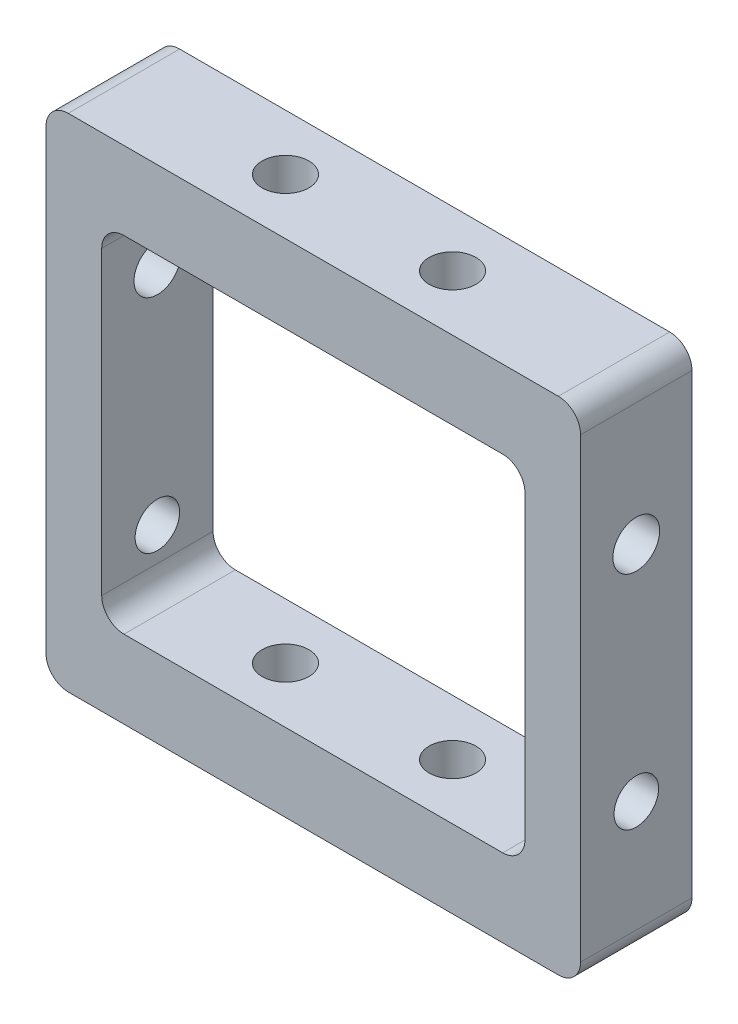
ISO-10303-21;
HEADER;
FILE_DESCRIPTION(('STEP AP214'),'2;1');
FILE_NAME('part.step','',(''),(''),'','','');
FILE_SCHEMA(('AUTOMOTIVE_DESIGN { 1 0 10303 214 1 1 1 1 }'));
ENDSEC;
DATA;
#1=APPLICATION_CONTEXT('core data for automotive mechanical design processes');
#2=APPLICATION_PROTOCOL_DEFINITION('international standard','automotive_design',2000,#1);
#3=PRODUCT_CONTEXT('',#1,'mechanical');
#4=PRODUCT('Part','Part','',(#3));
#5=PRODUCT_RELATED_PRODUCT_CATEGORY('part','',(#4));
#6=PRODUCT_DEFINITION_FORMATION('','',#4);
#7=PRODUCT_DEFINITION_CONTEXT('part definition',#1,'design');
#8=PRODUCT_DEFINITION('design','',#6,#7);
#9=PRODUCT_DEFINITION_SHAPE('','',#8);
#10=(LENGTH_UNIT() NAMED_UNIT(*) SI_UNIT(.MILLI.,.METRE.));
#11=(NAMED_UNIT(*) PLANE_ANGLE_UNIT() SI_UNIT($,.RADIAN.));
#12=(NAMED_UNIT(*) SI_UNIT($,.STERADIAN.) SOLID_ANGLE_UNIT());
#13=UNCERTAINTY_MEASURE_WITH_UNIT(LENGTH_MEASURE(1.E-05),#10,'distance_accuracy_value','');
#14=(GEOMETRIC_REPRESENTATION_CONTEXT(3) GLOBAL_UNCERTAINTY_ASSIGNED_CONTEXT((#13)) GLOBAL_UNIT_ASSIGNED_CONTEXT((#10,
#11,#12)) REPRESENTATION_CONTEXT('',''));
#15=CARTESIAN_POINT('',(0.,0.,0.));
#16=DIRECTION('',(0.,0.,1.));
#17=DIRECTION('',(1.,0.,0.));
#18=AXIS2_PLACEMENT_3D('',#15,#16,#17);
#19=CARTESIAN_POINT('',(-24.,22.5,10.));
#20=DIRECTION('',(0.,-1.,0.));
#21=DIRECTION('',(0.,0.,-1.));
#22=AXIS2_PLACEMENT_3D('',#19,#20,#21);
#23=PLANE('',#22);
#24=DIRECTION('',(-1.,0.,0.));
#25=VECTOR('',#24,1.);
#26=CARTESIAN_POINT('',(-24.,22.5,10.));
#27=LINE('',#26,#25);
#28=CARTESIAN_POINT('',(22.,22.5,10.));
#29=VERTEX_POINT('',#28);
#30=CARTESIAN_POINT('',(-22.,22.5,10.));
#31=VERTEX_POINT('',#30);
#32=EDGE_CURVE('E214',#29,#31,#27,.T.);
#33=ORIENTED_EDGE('',*,*,#32,.F.);
#34=DIRECTION('',(0.,0.,-1.));
#35=VECTOR('',#34,1.);
#36=CARTESIAN_POINT('',(22.,22.5,10.));
#37=LINE('',#36,#35);
#38=CARTESIAN_POINT('',(22.,22.5,0.));
#39=VERTEX_POINT('',#38);
#40=EDGE_CURVE('E11',#29,#39,#37,.T.);
#41=ORIENTED_EDGE('',*,*,#40,.T.);
#42=DIRECTION('',(-1.,0.,0.));
#43=VECTOR('',#42,1.);
#44=CARTESIAN_POINT('',(-24.,22.5,0.));
#45=LINE('',#44,#43);
#46=CARTESIAN_POINT('',(-22.,22.5,0.));
#47=VERTEX_POINT('',#46);
#48=EDGE_CURVE('E224',#39,#47,#45,.T.);
#49=ORIENTED_EDGE('',*,*,#48,.T.);
#50=DIRECTION('',(0.,0.,-1.));
#51=VECTOR('',#50,1.);
#52=CARTESIAN_POINT('',(-22.,22.5,10.));
#53=LINE('',#52,#51);
#54=EDGE_CURVE('E47',#47,#31,#53,.F.);
#55=ORIENTED_EDGE('',*,*,#54,.T.);
#56=EDGE_LOOP('',(#33,#41,#49,#55));
#57=FACE_BOUND('',#56,.T.);
#58=CARTESIAN_POINT('',(7.5,22.5,5.));
#59=DIRECTION('',(0.,1.,0.));
#60=DIRECTION('',(0.,0.,1.));
#61=AXIS2_PLACEMENT_3D('',#58,#59,#60);
#62=CIRCLE('',#61,2.09999999999999);
#63=CARTESIAN_POINT('',(7.5,22.5,7.09999999999998));
#64=VERTEX_POINT('',#63);
#65=EDGE_CURVE('E426',#64,#64,#62,.T.);
#66=ORIENTED_EDGE('',*,*,#65,.F.);
#67=EDGE_LOOP('',(#66));
#68=FACE_BOUND('',#67,.T.);
#69=CARTESIAN_POINT('',(-7.5,22.5,5.));
#70=DIRECTION('',(0.,1.,0.));
#71=DIRECTION('',(0.,0.,1.));
#72=AXIS2_PLACEMENT_3D('',#69,#70,#71);
#73=CIRCLE('',#72,2.09999999999999);
#74=CARTESIAN_POINT('',(-7.5,22.5,7.09999999999999));
#75=VERTEX_POINT('',#74);
#76=EDGE_CURVE('E668',#75,#75,#73,.T.);
#77=ORIENTED_EDGE('',*,*,#76,.F.);
#78=EDGE_LOOP('',(#77));
#79=FACE_BOUND('',#78,.T.);
#80=ADVANCED_FACE('F39',(#57,#68,#79),#23,.F.);
#81=CARTESIAN_POINT('',(24.,-22.5,10.));
#82=DIRECTION('',(-1.,0.,0.));
#83=DIRECTION('',(0.,0.,1.));
#84=AXIS2_PLACEMENT_3D('',#81,#82,#83);
#85=PLANE('',#84);
#86=CARTESIAN_POINT('',(24.,9.50000000000001,5.));
#87=DIRECTION('',(1.,0.,0.));
#88=DIRECTION('',(0.,0.,-1.));
#89=AXIS2_PLACEMENT_3D('',#86,#87,#88);
#90=CIRCLE('',#89,2.09999999999999);
#91=CARTESIAN_POINT('',(24.,9.50000000000001,2.90000000000001));
#92=VERTEX_POINT('',#91);
#93=EDGE_CURVE('E677',#92,#92,#90,.T.);
#94=ORIENTED_EDGE('',*,*,#93,.F.);
#95=EDGE_LOOP('',(#94));
#96=FACE_BOUND('',#95,.T.);
#97=CARTESIAN_POINT('',(24.,-10.5,5.));
#98=DIRECTION('',(1.,0.,0.));
#99=DIRECTION('',(0.,0.,-1.));
#100=AXIS2_PLACEMENT_3D('',#97,#98,#99);
#101=CIRCLE('',#100,2.);
#102=CARTESIAN_POINT('',(24.,-10.5,3.));
#103=VERTEX_POINT('',#102);
#104=EDGE_CURVE('E207',#103,#103,#101,.T.);
#105=ORIENTED_EDGE('',*,*,#104,.F.);
#106=EDGE_LOOP('',(#105));
#107=FACE_BOUND('',#106,.T.);
#108=DIRECTION('',(0.,1.,0.));
#109=VECTOR('',#108,1.);
#110=CARTESIAN_POINT('',(24.,-22.5,10.));
#111=LINE('',#110,#109);
#112=CARTESIAN_POINT('',(24.,-20.5,10.));
#113=VERTEX_POINT('',#112);
#114=CARTESIAN_POINT('',(24.,20.5,10.));
#115=VERTEX_POINT('',#114);
#116=EDGE_CURVE('E211',#113,#115,#111,.T.);
#117=ORIENTED_EDGE('',*,*,#116,.F.);
#118=DIRECTION('',(0.,0.,-1.));
#119=VECTOR('',#118,1.);
#120=CARTESIAN_POINT('',(24.,-20.5,10.));
#121=LINE('',#120,#119);
#122=CARTESIAN_POINT('',(24.,-20.5,0.));
#123=VERTEX_POINT('',#122);
#124=EDGE_CURVE('E276',#113,#123,#121,.T.);
#125=ORIENTED_EDGE('',*,*,#124,.T.);
#126=DIRECTION('',(0.,1.,0.));
#127=VECTOR('',#126,1.);
#128=CARTESIAN_POINT('',(24.,-22.5,0.));
#129=LINE('',#128,#127);
#130=CARTESIAN_POINT('',(24.,20.5,0.));
#131=VERTEX_POINT('',#130);
#132=EDGE_CURVE('E206',#123,#131,#129,.T.);
#133=ORIENTED_EDGE('',*,*,#132,.T.);
#134=DIRECTION('',(0.,0.,-1.));
#135=VECTOR('',#134,1.);
#136=CARTESIAN_POINT('',(24.,20.5,10.));
#137=LINE('',#136,#135);
#138=EDGE_CURVE('E259',#131,#115,#137,.F.);
#139=ORIENTED_EDGE('',*,*,#138,.T.);
#140=EDGE_LOOP('',(#117,#125,#133,#139));
#141=FACE_BOUND('',#140,.T.);
#142=ADVANCED_FACE('F331',(#96,#107,#141),#85,.F.);
#143=CARTESIAN_POINT('',(-24.,-22.5,10.));
#144=DIRECTION('',(1.,0.,0.));
#145=DIRECTION('',(0.,0.,-1.));
#146=AXIS2_PLACEMENT_3D('',#143,#144,#145);
#147=PLANE('',#146);
#148=CARTESIAN_POINT('',(-24.,9.50000000000001,5.));
#149=DIRECTION('',(1.,0.,0.));
#150=DIRECTION('',(0.,0.,-1.));
#151=AXIS2_PLACEMENT_3D('',#148,#149,#150);
#152=CIRCLE('',#151,2.09999999999999);
#153=CARTESIAN_POINT('',(-24.,9.50000000000001,2.90000000000001));
#154=VERTEX_POINT('',#153);
#155=EDGE_CURVE('E274',#154,#154,#152,.T.);
#156=ORIENTED_EDGE('',*,*,#155,.T.);
#157=EDGE_LOOP('',(#156));
#158=FACE_BOUND('',#157,.T.);
#159=CARTESIAN_POINT('',(-24.,-10.5,5.));
#160=DIRECTION('',(1.,0.,0.));
#161=DIRECTION('',(0.,0.,-1.));
#162=AXIS2_PLACEMENT_3D('',#159,#160,#161);
#163=CIRCLE('',#162,2.);
#164=CARTESIAN_POINT('',(-24.,-10.5,3.));
#165=VERTEX_POINT('',#164);
#166=EDGE_CURVE('E203',#165,#165,#163,.T.);
#167=ORIENTED_EDGE('',*,*,#166,.T.);
#168=EDGE_LOOP('',(#167));
#169=FACE_BOUND('',#168,.T.);
#170=DIRECTION('',(0.,-1.,0.));
#171=VECTOR('',#170,1.);
#172=CARTESIAN_POINT('',(-24.,-22.5,0.));
#173=LINE('',#172,#171);
#174=CARTESIAN_POINT('',(-24.,20.5,0.));
#175=VERTEX_POINT('',#174);
#176=CARTESIAN_POINT('',(-24.,-20.5,0.));
#177=VERTEX_POINT('',#176);
#178=EDGE_CURVE('E227',#175,#177,#173,.T.);
#179=ORIENTED_EDGE('',*,*,#178,.T.);
#180=DIRECTION('',(0.,0.,-1.));
#181=VECTOR('',#180,1.);
#182=CARTESIAN_POINT('',(-24.,-20.5,10.));
#183=LINE('',#182,#181);
#184=CARTESIAN_POINT('',(-24.,-20.5,10.));
#185=VERTEX_POINT('',#184);
#186=EDGE_CURVE('E54',#177,#185,#183,.F.);
#187=ORIENTED_EDGE('',*,*,#186,.T.);
#188=DIRECTION('',(0.,-1.,0.));
#189=VECTOR('',#188,1.);
#190=CARTESIAN_POINT('',(-24.,-22.5,10.));
#191=LINE('',#190,#189);
#192=CARTESIAN_POINT('',(-24.,20.5,10.));
#193=VERTEX_POINT('',#192);
#194=EDGE_CURVE('E217',#193,#185,#191,.T.);
#195=ORIENTED_EDGE('',*,*,#194,.F.);
#196=DIRECTION('',(0.,0.,-1.));
#197=VECTOR('',#196,1.);
#198=CARTESIAN_POINT('',(-24.,20.5,10.));
#199=LINE('',#198,#197);
#200=EDGE_CURVE('E299',#193,#175,#199,.T.);
#201=ORIENTED_EDGE('',*,*,#200,.T.);
#202=EDGE_LOOP('',(#179,#187,#195,#201));
#203=FACE_BOUND('',#202,.T.);
#204=ADVANCED_FACE('F312',(#158,#169,#203),#147,.F.);
#205=CARTESIAN_POINT('',(-24.,-22.5,10.));
#206=DIRECTION('',(0.,1.,0.));
#207=DIRECTION('',(0.,0.,1.));
#208=AXIS2_PLACEMENT_3D('',#205,#206,#207);
#209=PLANE('',#208);
#210=CARTESIAN_POINT('',(-7.5,-22.5,5.));
#211=DIRECTION('',(0.,1.,0.));
#212=DIRECTION('',(0.,0.,1.));
#213=AXIS2_PLACEMENT_3D('',#210,#211,#212);
#214=CIRCLE('',#213,2.09999999999999);
#215=CARTESIAN_POINT('',(-7.5,-22.5,7.09999999999999));
#216=VERTEX_POINT('',#215);
#217=EDGE_CURVE('E269',#216,#216,#214,.T.);
#218=ORIENTED_EDGE('',*,*,#217,.T.);
#219=EDGE_LOOP('',(#218));
#220=FACE_BOUND('',#219,.T.);
#221=CARTESIAN_POINT('',(7.5,-22.5,5.));
#222=DIRECTION('',(0.,1.,0.));
#223=DIRECTION('',(0.,0.,1.));
#224=AXIS2_PLACEMENT_3D('',#221,#222,#223);
#225=CIRCLE('',#224,2.09999999999999);
#226=CARTESIAN_POINT('',(7.5,-22.5,7.09999999999999));
#227=VERTEX_POINT('',#226);
#228=EDGE_CURVE('E264',#227,#227,#225,.T.);
#229=ORIENTED_EDGE('',*,*,#228,.T.);
#230=EDGE_LOOP('',(#229));
#231=FACE_BOUND('',#230,.T.);
#232=DIRECTION('',(1.,0.,0.));
#233=VECTOR('',#232,1.);
#234=CARTESIAN_POINT('',(-24.,-22.5,0.));
#235=LINE('',#234,#233);
#236=CARTESIAN_POINT('',(-22.,-22.5,0.));
#237=VERTEX_POINT('',#236);
#238=CARTESIAN_POINT('',(22.,-22.5,0.));
#239=VERTEX_POINT('',#238);
#240=EDGE_CURVE('E215',#237,#239,#235,.T.);
#241=ORIENTED_EDGE('',*,*,#240,.T.);
#242=DIRECTION('',(0.,0.,-1.));
#243=VECTOR('',#242,1.);
#244=CARTESIAN_POINT('',(22.,-22.5,10.));
#245=LINE('',#244,#243);
#246=CARTESIAN_POINT('',(22.,-22.5,10.));
#247=VERTEX_POINT('',#246);
#248=EDGE_CURVE('E290',#239,#247,#245,.F.);
#249=ORIENTED_EDGE('',*,*,#248,.T.);
#250=DIRECTION('',(1.,0.,0.));
#251=VECTOR('',#250,1.);
#252=CARTESIAN_POINT('',(-24.,-22.5,10.));
#253=LINE('',#252,#251);
#254=CARTESIAN_POINT('',(-22.,-22.5,10.));
#255=VERTEX_POINT('',#254);
#256=EDGE_CURVE('E219',#255,#247,#253,.T.);
#257=ORIENTED_EDGE('',*,*,#256,.F.);
#258=DIRECTION('',(0.,0.,-1.));
#259=VECTOR('',#258,1.);
#260=CARTESIAN_POINT('',(-22.,-22.5,10.));
#261=LINE('',#260,#259);
#262=EDGE_CURVE('E287',#255,#237,#261,.T.);
#263=ORIENTED_EDGE('',*,*,#262,.T.);
#264=EDGE_LOOP('',(#241,#249,#257,#263));
#265=FACE_BOUND('',#264,.T.);
#266=ADVANCED_FACE('F323',(#220,#231,#265),#209,.F.);
#267=CARTESIAN_POINT('',(0.,0.,10.));
#268=DIRECTION('',(0.,0.,-1.));
#269=DIRECTION('',(-1.,0.,0.));
#270=AXIS2_PLACEMENT_3D('',#267,#268,#269);
#271=PLANE('',#270);
#272=DIRECTION('',(0.,-1.,0.));
#273=VECTOR('',#272,1.);
#274=CARTESIAN_POINT('',(-19.,0.999999999999998,10.));
#275=LINE('',#274,#273);
#276=CARTESIAN_POINT('',(-19.,13.5,10.));
#277=VERTEX_POINT('',#276);
#278=CARTESIAN_POINT('',(-19.,-13.5,10.));
#279=VERTEX_POINT('',#278);
#280=EDGE_CURVE('E185',#277,#279,#275,.T.);
#281=ORIENTED_EDGE('',*,*,#280,.F.);
#282=CARTESIAN_POINT('',(-17.,13.5,10.));
#283=DIRECTION('',(0.,0.,-1.));
#284=DIRECTION('',(-1.,0.,0.));
#285=AXIS2_PLACEMENT_3D('',#282,#283,#284);
#286=CIRCLE('',#285,2.);
#287=CARTESIAN_POINT('',(-17.,15.5,10.));
#288=VERTEX_POINT('',#287);
#289=EDGE_CURVE('E257',#277,#288,#286,.T.);
#290=ORIENTED_EDGE('',*,*,#289,.T.);
#291=DIRECTION('',(-1.,0.,0.));
#292=VECTOR('',#291,1.);
#293=CARTESIAN_POINT('',(19.,15.5,10.));
#294=LINE('',#293,#292);
#295=CARTESIAN_POINT('',(17.,15.5,10.));
#296=VERTEX_POINT('',#295);
#297=EDGE_CURVE('E188',#296,#288,#294,.T.);
#298=ORIENTED_EDGE('',*,*,#297,.F.);
#299=CARTESIAN_POINT('',(17.,13.5,10.));
#300=DIRECTION('',(0.,0.,-1.));
#301=DIRECTION('',(-1.,0.,0.));
#302=AXIS2_PLACEMENT_3D('',#299,#300,#301);
#303=CIRCLE('',#302,2.);
#304=CARTESIAN_POINT('',(19.,13.5,10.));
#305=VERTEX_POINT('',#304);
#306=EDGE_CURVE('E251',#296,#305,#303,.T.);
#307=ORIENTED_EDGE('',*,*,#306,.T.);
#308=DIRECTION('',(0.,1.,0.));
#309=VECTOR('',#308,1.);
#310=CARTESIAN_POINT('',(19.,-1.99999999999999,10.));
#311=LINE('',#310,#309);
#312=CARTESIAN_POINT('',(19.,-13.5,10.));
#313=VERTEX_POINT('',#312);
#314=EDGE_CURVE('E196',#313,#305,#311,.T.);
#315=ORIENTED_EDGE('',*,*,#314,.F.);
#316=CARTESIAN_POINT('',(17.,-13.5,10.));
#317=DIRECTION('',(0.,0.,-1.));
#318=DIRECTION('',(-1.,0.,0.));
#319=AXIS2_PLACEMENT_3D('',#316,#317,#318);
#320=CIRCLE('',#319,2.);
#321=CARTESIAN_POINT('',(17.,-15.5,10.));
#322=VERTEX_POINT('',#321);
#323=EDGE_CURVE('E182',#313,#322,#320,.T.);
#324=ORIENTED_EDGE('',*,*,#323,.T.);
#325=DIRECTION('',(1.,0.,0.));
#326=VECTOR('',#325,1.);
#327=CARTESIAN_POINT('',(-19.,-15.5,10.));
#328=LINE('',#327,#326);
#329=CARTESIAN_POINT('',(-17.,-15.5,10.));
#330=VERTEX_POINT('',#329);
#331=EDGE_CURVE('E172',#330,#322,#328,.T.);
#332=ORIENTED_EDGE('',*,*,#331,.F.);
#333=CARTESIAN_POINT('',(-17.,-13.5,10.));
#334=DIRECTION('',(0.,0.,-1.));
#335=DIRECTION('',(-1.,0.,0.));
#336=AXIS2_PLACEMENT_3D('',#333,#334,#335);
#337=CIRCLE('',#336,2.);
#338=EDGE_CURVE('E154',#330,#279,#337,.T.);
#339=ORIENTED_EDGE('',*,*,#338,.T.);
#340=EDGE_LOOP('',(#281,#290,#298,#307,#315,#324,#332,#339));
#341=FACE_BOUND('',#340,.T.);
#342=ORIENTED_EDGE('',*,*,#256,.T.);
#343=CARTESIAN_POINT('',(22.,-20.5,10.));
#344=DIRECTION('',(0.,0.,-1.));
#345=DIRECTION('',(-1.,0.,0.));
#346=AXIS2_PLACEMENT_3D('',#343,#344,#345);
#347=CIRCLE('',#346,2.);
#348=EDGE_CURVE('E297',#247,#113,#347,.F.);
#349=ORIENTED_EDGE('',*,*,#348,.T.);
#350=ORIENTED_EDGE('',*,*,#116,.T.);
#351=CARTESIAN_POINT('',(22.,20.5,10.));
#352=DIRECTION('',(0.,0.,-1.));
#353=DIRECTION('',(-1.,0.,0.));
#354=AXIS2_PLACEMENT_3D('',#351,#352,#353);
#355=CIRCLE('',#354,2.);
#356=EDGE_CURVE('E293',#115,#29,#355,.F.);
#357=ORIENTED_EDGE('',*,*,#356,.T.);
#358=ORIENTED_EDGE('',*,*,#32,.T.);
#359=CARTESIAN_POINT('',(-22.,20.5,10.));
#360=DIRECTION('',(0.,0.,-1.));
#361=DIRECTION('',(-1.,0.,0.));
#362=AXIS2_PLACEMENT_3D('',#359,#360,#361);
#363=CIRCLE('',#362,2.);
#364=EDGE_CURVE('E61',#31,#193,#363,.F.);
#365=ORIENTED_EDGE('',*,*,#364,.T.);
#366=ORIENTED_EDGE('',*,*,#194,.T.);
#367=CARTESIAN_POINT('',(-22.,-20.5,10.));
#368=DIRECTION('',(0.,0.,-1.));
#369=DIRECTION('',(-1.,0.,0.));
#370=AXIS2_PLACEMENT_3D('',#367,#368,#369);
#371=CIRCLE('',#370,2.);
#372=EDGE_CURVE('E295',#185,#255,#371,.F.);
#373=ORIENTED_EDGE('',*,*,#372,.T.);
#374=EDGE_LOOP('',(#342,#349,#350,#357,#358,#365,#366,#373));
#375=FACE_BOUND('',#374,.T.);
#376=ADVANCED_FACE('F179',(#341,#375),#271,.F.);
#377=CARTESIAN_POINT('',(0.,0.,0.));
#378=DIRECTION('',(0.,0.,-1.));
#379=DIRECTION('',(-1.,0.,0.));
#380=AXIS2_PLACEMENT_3D('',#377,#378,#379);
#381=PLANE('',#380);
#382=DIRECTION('',(1.,0.,0.));
#383=VECTOR('',#382,1.);
#384=CARTESIAN_POINT('',(-19.,15.5,0.));
#385=LINE('',#384,#383);
#386=CARTESIAN_POINT('',(-17.,15.5,0.));
#387=VERTEX_POINT('',#386);
#388=CARTESIAN_POINT('',(17.,15.5,0.));
#389=VERTEX_POINT('',#388);
#390=EDGE_CURVE('E183',#387,#389,#385,.T.);
#391=ORIENTED_EDGE('',*,*,#390,.F.);
#392=CARTESIAN_POINT('',(-17.,13.5,0.));
#393=DIRECTION('',(0.,0.,-1.));
#394=DIRECTION('',(-1.,0.,0.));
#395=AXIS2_PLACEMENT_3D('',#392,#393,#394);
#396=CIRCLE('',#395,2.);
#397=CARTESIAN_POINT('',(-19.,13.5,0.));
#398=VERTEX_POINT('',#397);
#399=EDGE_CURVE('E255',#387,#398,#396,.F.);
#400=ORIENTED_EDGE('',*,*,#399,.T.);
#401=DIRECTION('',(0.,-1.,0.));
#402=VECTOR('',#401,1.);
#403=CARTESIAN_POINT('',(-19.,0.999999999999998,0.));
#404=LINE('',#403,#402);
#405=CARTESIAN_POINT('',(-19.,-13.5,0.));
#406=VERTEX_POINT('',#405);
#407=EDGE_CURVE('E199',#398,#406,#404,.T.);
#408=ORIENTED_EDGE('',*,*,#407,.T.);
#409=CARTESIAN_POINT('',(-17.,-13.5,0.));
#410=DIRECTION('',(0.,0.,-1.));
#411=DIRECTION('',(-1.,0.,0.));
#412=AXIS2_PLACEMENT_3D('',#409,#410,#411);
#413=CIRCLE('',#412,2.);
#414=CARTESIAN_POINT('',(-17.,-15.5,0.));
#415=VERTEX_POINT('',#414);
#416=EDGE_CURVE('E164',#406,#415,#413,.F.);
#417=ORIENTED_EDGE('',*,*,#416,.T.);
#418=DIRECTION('',(-1.,0.,0.));
#419=VECTOR('',#418,1.);
#420=CARTESIAN_POINT('',(19.,-15.5,0.));
#421=LINE('',#420,#419);
#422=CARTESIAN_POINT('',(17.,-15.5,0.));
#423=VERTEX_POINT('',#422);
#424=EDGE_CURVE('E175',#423,#415,#421,.T.);
#425=ORIENTED_EDGE('',*,*,#424,.F.);
#426=CARTESIAN_POINT('',(17.,-13.5,0.));
#427=DIRECTION('',(0.,0.,-1.));
#428=DIRECTION('',(-1.,0.,0.));
#429=AXIS2_PLACEMENT_3D('',#426,#427,#428);
#430=CIRCLE('',#429,2.);
#431=CARTESIAN_POINT('',(19.,-13.5,0.));
#432=VERTEX_POINT('',#431);
#433=EDGE_CURVE('E248',#423,#432,#430,.F.);
#434=ORIENTED_EDGE('',*,*,#433,.T.);
#435=DIRECTION('',(0.,1.,0.));
#436=VECTOR('',#435,1.);
#437=CARTESIAN_POINT('',(19.,-1.99999999999999,0.));
#438=LINE('',#437,#436);
#439=CARTESIAN_POINT('',(19.,13.5,0.));
#440=VERTEX_POINT('',#439);
#441=EDGE_CURVE('E192',#432,#440,#438,.T.);
#442=ORIENTED_EDGE('',*,*,#441,.T.);
#443=CARTESIAN_POINT('',(17.,13.5,0.));
#444=DIRECTION('',(0.,0.,-1.));
#445=DIRECTION('',(-1.,0.,0.));
#446=AXIS2_PLACEMENT_3D('',#443,#444,#445);
#447=CIRCLE('',#446,2.);
#448=EDGE_CURVE('E253',#440,#389,#447,.F.);
#449=ORIENTED_EDGE('',*,*,#448,.T.);
#450=EDGE_LOOP('',(#391,#400,#408,#417,#425,#434,#442,#449));
#451=FACE_BOUND('',#450,.T.);
#452=ORIENTED_EDGE('',*,*,#132,.F.);
#453=CARTESIAN_POINT('',(22.,-20.5,0.));
#454=DIRECTION('',(0.,0.,-1.));
#455=DIRECTION('',(-1.,0.,0.));
#456=AXIS2_PLACEMENT_3D('',#453,#454,#455);
#457=CIRCLE('',#456,2.);
#458=EDGE_CURVE('E285',#123,#239,#457,.T.);
#459=ORIENTED_EDGE('',*,*,#458,.T.);
#460=ORIENTED_EDGE('',*,*,#240,.F.);
#461=CARTESIAN_POINT('',(-22.,-20.5,0.));
#462=DIRECTION('',(0.,0.,-1.));
#463=DIRECTION('',(-1.,0.,0.));
#464=AXIS2_PLACEMENT_3D('',#461,#462,#463);
#465=CIRCLE('',#464,2.);
#466=EDGE_CURVE('E283',#237,#177,#465,.T.);
#467=ORIENTED_EDGE('',*,*,#466,.T.);
#468=ORIENTED_EDGE('',*,*,#178,.F.);
#469=CARTESIAN_POINT('',(-22.,20.5,0.));
#470=DIRECTION('',(0.,0.,-1.));
#471=DIRECTION('',(-1.,0.,0.));
#472=AXIS2_PLACEMENT_3D('',#469,#470,#471);
#473=CIRCLE('',#472,2.);
#474=EDGE_CURVE('E279',#175,#47,#473,.T.);
#475=ORIENTED_EDGE('',*,*,#474,.T.);
#476=ORIENTED_EDGE('',*,*,#48,.F.);
#477=CARTESIAN_POINT('',(22.,20.5,0.));
#478=DIRECTION('',(0.,0.,-1.));
#479=DIRECTION('',(-1.,0.,0.));
#480=AXIS2_PLACEMENT_3D('',#477,#478,#479);
#481=CIRCLE('',#480,2.);
#482=EDGE_CURVE('E281',#39,#131,#481,.T.);
#483=ORIENTED_EDGE('',*,*,#482,.T.);
#484=EDGE_LOOP('',(#452,#459,#460,#467,#468,#475,#476,#483));
#485=FACE_BOUND('',#484,.T.);
#486=ADVANCED_FACE('F315',(#451,#485),#381,.T.);
#487=CARTESIAN_POINT('',(-24.,-10.5,5.));
#488=DIRECTION('',(1.,0.,0.));
#489=DIRECTION('',(0.,0.,-1.));
#490=AXIS2_PLACEMENT_3D('',#487,#488,#489);
#491=CYLINDRICAL_SURFACE('',#490,2.);
#492=CARTESIAN_POINT('',(19.,-10.5,5.));
#493=DIRECTION('',(1.,0.,0.));
#494=DIRECTION('',(0.,1.,0.));
#495=AXIS2_PLACEMENT_3D('',#492,#493,#494);
#496=CIRCLE('',#495,2.);
#497=CARTESIAN_POINT('',(19.,-8.49999999999999,5.));
#498=VERTEX_POINT('',#497);
#499=EDGE_CURVE('E210',#498,#498,#496,.F.);
#500=ORIENTED_EDGE('',*,*,#499,.T.);
#501=EDGE_LOOP('',(#500));
#502=FACE_BOUND('',#501,.T.);
#503=ORIENTED_EDGE('',*,*,#104,.T.);
#504=EDGE_LOOP('',(#503));
#505=FACE_BOUND('',#504,.T.);
#506=ADVANCED_FACE('F408',(#502,#505),#491,.F.);
#507=CARTESIAN_POINT('',(-19.,-10.5,5.));
#508=DIRECTION('',(-1.,0.,0.));
#509=DIRECTION('',(0.,0.,1.));
#510=AXIS2_PLACEMENT_3D('',#507,#508,#509);
#511=CIRCLE('',#510,2.);
#512=CARTESIAN_POINT('',(-19.,-10.5,7.));
#513=VERTEX_POINT('',#512);
#514=EDGE_CURVE('E195',#513,#513,#511,.F.);
#515=ORIENTED_EDGE('',*,*,#514,.T.);
#516=EDGE_LOOP('',(#515));
#517=FACE_BOUND('',#516,.T.);
#518=ORIENTED_EDGE('',*,*,#166,.F.);
#519=EDGE_LOOP('',(#518));
#520=FACE_BOUND('',#519,.T.);
#521=ADVANCED_FACE('F404',(#517,#520),#491,.F.);
#522=CARTESIAN_POINT('',(-19.,0.999999999999998,0.));
#523=DIRECTION('',(-1.,0.,0.));
#524=DIRECTION('',(0.,-1.,0.));
#525=AXIS2_PLACEMENT_3D('',#522,#523,#524);
#526=PLANE('',#525);
#527=CARTESIAN_POINT('',(-19.,9.50000000000001,5.));
#528=DIRECTION('',(-1.,0.,0.));
#529=DIRECTION('',(0.,-1.,0.));
#530=AXIS2_PLACEMENT_3D('',#527,#528,#529);
#531=CIRCLE('',#530,2.09999999999999);
#532=CARTESIAN_POINT('',(-19.,7.40000000000002,5.));
#533=VERTEX_POINT('',#532);
#534=EDGE_CURVE('E273',#533,#533,#531,.T.);
#535=ORIENTED_EDGE('',*,*,#534,.T.);
#536=EDGE_LOOP('',(#535));
#537=FACE_BOUND('',#536,.T.);
#538=ORIENTED_EDGE('',*,*,#280,.T.);
#539=DIRECTION('',(0.,0.,1.));
#540=VECTOR('',#539,1.);
#541=CARTESIAN_POINT('',(-19.,-13.5,0.));
#542=LINE('',#541,#540);
#543=EDGE_CURVE('E159',#279,#406,#542,.F.);
#544=ORIENTED_EDGE('',*,*,#543,.T.);
#545=ORIENTED_EDGE('',*,*,#407,.F.);
#546=DIRECTION('',(0.,0.,-1.));
#547=VECTOR('',#546,1.);
#548=CARTESIAN_POINT('',(-19.,13.5,0.));
#549=LINE('',#548,#547);
#550=EDGE_CURVE('E176',#398,#277,#549,.F.);
#551=ORIENTED_EDGE('',*,*,#550,.T.);
#552=EDGE_LOOP('',(#538,#544,#545,#551));
#553=FACE_BOUND('',#552,.T.);
#554=ORIENTED_EDGE('',*,*,#514,.F.);
#555=EDGE_LOOP('',(#554));
#556=FACE_BOUND('',#555,.T.);
#557=ADVANCED_FACE('F400',(#537,#553,#556),#526,.F.);
#558=CARTESIAN_POINT('',(19.,-1.99999999999999,0.));
#559=DIRECTION('',(1.,0.,0.));
#560=DIRECTION('',(0.,1.,0.));
#561=AXIS2_PLACEMENT_3D('',#558,#559,#560);
#562=PLANE('',#561);
#563=CARTESIAN_POINT('',(19.,9.50000000000001,5.));
#564=DIRECTION('',(1.,0.,0.));
#565=DIRECTION('',(0.,1.,0.));
#566=AXIS2_PLACEMENT_3D('',#563,#564,#565);
#567=CIRCLE('',#566,2.09999999999999);
#568=CARTESIAN_POINT('',(19.,11.6,5.));
#569=VERTEX_POINT('',#568);
#570=EDGE_CURVE('E270',#569,#569,#567,.T.);
#571=ORIENTED_EDGE('',*,*,#570,.T.);
#572=EDGE_LOOP('',(#571));
#573=FACE_BOUND('',#572,.T.);
#574=ORIENTED_EDGE('',*,*,#441,.F.);
#575=DIRECTION('',(0.,0.,-1.));
#576=VECTOR('',#575,1.);
#577=CARTESIAN_POINT('',(19.,-13.5,0.));
#578=LINE('',#577,#576);
#579=EDGE_CURVE('E240',#432,#313,#578,.F.);
#580=ORIENTED_EDGE('',*,*,#579,.T.);
#581=ORIENTED_EDGE('',*,*,#314,.T.);
#582=DIRECTION('',(0.,0.,1.));
#583=VECTOR('',#582,1.);
#584=CARTESIAN_POINT('',(19.,13.5,0.));
#585=LINE('',#584,#583);
#586=EDGE_CURVE('E238',#305,#440,#585,.F.);
#587=ORIENTED_EDGE('',*,*,#586,.T.);
#588=EDGE_LOOP('',(#574,#580,#581,#587));
#589=FACE_BOUND('',#588,.T.);
#590=ORIENTED_EDGE('',*,*,#499,.F.);
#591=EDGE_LOOP('',(#590));
#592=FACE_BOUND('',#591,.T.);
#593=ADVANCED_FACE('F396',(#573,#589,#592),#562,.F.);
#594=CARTESIAN_POINT('',(0.,-15.5,0.));
#595=DIRECTION('',(0.,1.,0.));
#596=DIRECTION('',(-1.,0.,0.));
#597=AXIS2_PLACEMENT_3D('',#594,#595,#596);
#598=PLANE('',#597);
#599=CARTESIAN_POINT('',(-7.5,-15.5,5.));
#600=DIRECTION('',(0.,1.,0.));
#601=DIRECTION('',(-1.,0.,0.));
#602=AXIS2_PLACEMENT_3D('',#599,#600,#601);
#603=CIRCLE('',#602,2.09999999999999);
#604=CARTESIAN_POINT('',(-9.59999999999999,-15.5,5.));
#605=VERTEX_POINT('',#604);
#606=EDGE_CURVE('E268',#605,#605,#603,.T.);
#607=ORIENTED_EDGE('',*,*,#606,.F.);
#608=EDGE_LOOP('',(#607));
#609=FACE_BOUND('',#608,.T.);
#610=CARTESIAN_POINT('',(7.5,-15.5,5.));
#611=DIRECTION('',(0.,1.,0.));
#612=DIRECTION('',(-1.,0.,0.));
#613=AXIS2_PLACEMENT_3D('',#610,#611,#612);
#614=CIRCLE('',#613,2.09999999999999);
#615=CARTESIAN_POINT('',(5.40000000000001,-15.5,5.));
#616=VERTEX_POINT('',#615);
#617=EDGE_CURVE('E263',#616,#616,#614,.T.);
#618=ORIENTED_EDGE('',*,*,#617,.F.);
#619=EDGE_LOOP('',(#618));
#620=FACE_BOUND('',#619,.T.);
#621=ORIENTED_EDGE('',*,*,#424,.T.);
#622=DIRECTION('',(0.,0.,1.));
#623=VECTOR('',#622,1.);
#624=CARTESIAN_POINT('',(-17.,-15.5,0.));
#625=LINE('',#624,#623);
#626=EDGE_CURVE('E158',#415,#330,#625,.T.);
#627=ORIENTED_EDGE('',*,*,#626,.T.);
#628=ORIENTED_EDGE('',*,*,#331,.T.);
#629=DIRECTION('',(0.,0.,-1.));
#630=VECTOR('',#629,1.);
#631=CARTESIAN_POINT('',(17.,-15.5,0.));
#632=LINE('',#631,#630);
#633=EDGE_CURVE('E177',#322,#423,#632,.T.);
#634=ORIENTED_EDGE('',*,*,#633,.T.);
#635=EDGE_LOOP('',(#621,#627,#628,#634));
#636=FACE_BOUND('',#635,.T.);
#637=ADVANCED_FACE('F170',(#609,#620,#636),#598,.T.);
#638=CARTESIAN_POINT('',(0.,15.5,0.));
#639=DIRECTION('',(0.,-1.,0.));
#640=DIRECTION('',(0.,0.,-1.));
#641=AXIS2_PLACEMENT_3D('',#638,#639,#640);
#642=PLANE('',#641);
#643=CARTESIAN_POINT('',(-7.5,15.5,5.));
#644=DIRECTION('',(0.,-1.,0.));
#645=DIRECTION('',(0.,0.,-1.));
#646=AXIS2_PLACEMENT_3D('',#643,#644,#645);
#647=CIRCLE('',#646,2.09999999999999);
#648=CARTESIAN_POINT('',(-7.5,15.5,2.90000000000001));
#649=VERTEX_POINT('',#648);
#650=EDGE_CURVE('E265',#649,#649,#647,.T.);
#651=ORIENTED_EDGE('',*,*,#650,.F.);
#652=EDGE_LOOP('',(#651));
#653=FACE_BOUND('',#652,.T.);
#654=CARTESIAN_POINT('',(7.5,15.5,5.));
#655=DIRECTION('',(0.,-1.,0.));
#656=DIRECTION('',(0.,0.,-1.));
#657=AXIS2_PLACEMENT_3D('',#654,#655,#656);
#658=CIRCLE('',#657,2.09999999999999);
#659=CARTESIAN_POINT('',(7.5,15.5,2.90000000000001));
#660=VERTEX_POINT('',#659);
#661=EDGE_CURVE('E260',#660,#660,#658,.T.);
#662=ORIENTED_EDGE('',*,*,#661,.F.);
#663=EDGE_LOOP('',(#662));
#664=FACE_BOUND('',#663,.T.);
#665=ORIENTED_EDGE('',*,*,#390,.T.);
#666=DIRECTION('',(0.,0.,1.));
#667=VECTOR('',#666,1.);
#668=CARTESIAN_POINT('',(17.,15.5,0.));
#669=LINE('',#668,#667);
#670=EDGE_CURVE('E165',#389,#296,#669,.T.);
#671=ORIENTED_EDGE('',*,*,#670,.T.);
#672=ORIENTED_EDGE('',*,*,#297,.T.);
#673=DIRECTION('',(0.,0.,-1.));
#674=VECTOR('',#673,1.);
#675=CARTESIAN_POINT('',(-17.,15.5,0.));
#676=LINE('',#675,#674);
#677=EDGE_CURVE('E242',#288,#387,#676,.T.);
#678=ORIENTED_EDGE('',*,*,#677,.T.);
#679=EDGE_LOOP('',(#665,#671,#672,#678));
#680=FACE_BOUND('',#679,.T.);
#681=ADVANCED_FACE('F354',(#653,#664,#680),#642,.T.);
#682=CARTESIAN_POINT('',(-17.,-13.5,0.));
#683=DIRECTION('',(0.,0.,1.));
#684=DIRECTION('',(1.,0.,0.));
#685=AXIS2_PLACEMENT_3D('',#682,#683,#684);
#686=CYLINDRICAL_SURFACE('',#685,2.);
#687=ORIENTED_EDGE('',*,*,#416,.F.);
#688=ORIENTED_EDGE('',*,*,#543,.F.);
#689=ORIENTED_EDGE('',*,*,#338,.F.);
#690=ORIENTED_EDGE('',*,*,#626,.F.);
#691=EDGE_LOOP('',(#687,#688,#689,#690));
#692=FACE_BOUND('',#691,.T.);
#693=ADVANCED_FACE('F157',(#692),#686,.F.);
#694=CARTESIAN_POINT('',(17.,-13.5,0.));
#695=DIRECTION('',(0.,0.,-1.));
#696=DIRECTION('',(-1.,0.,0.));
#697=AXIS2_PLACEMENT_3D('',#694,#695,#696);
#698=CYLINDRICAL_SURFACE('',#697,2.);
#699=ORIENTED_EDGE('',*,*,#323,.F.);
#700=ORIENTED_EDGE('',*,*,#579,.F.);
#701=ORIENTED_EDGE('',*,*,#433,.F.);
#702=ORIENTED_EDGE('',*,*,#633,.F.);
#703=EDGE_LOOP('',(#699,#700,#701,#702));
#704=FACE_BOUND('',#703,.T.);
#705=ADVANCED_FACE('F353',(#704),#698,.F.);
#706=CARTESIAN_POINT('',(17.,13.5,0.));
#707=DIRECTION('',(0.,0.,1.));
#708=DIRECTION('',(1.,0.,0.));
#709=AXIS2_PLACEMENT_3D('',#706,#707,#708);
#710=CYLINDRICAL_SURFACE('',#709,2.);
#711=ORIENTED_EDGE('',*,*,#448,.F.);
#712=ORIENTED_EDGE('',*,*,#586,.F.);
#713=ORIENTED_EDGE('',*,*,#306,.F.);
#714=ORIENTED_EDGE('',*,*,#670,.F.);
#715=EDGE_LOOP('',(#711,#712,#713,#714));
#716=FACE_BOUND('',#715,.T.);
#717=ADVANCED_FACE('F357',(#716),#710,.F.);
#718=CARTESIAN_POINT('',(-17.,13.5,0.));
#719=DIRECTION('',(0.,0.,-1.));
#720=DIRECTION('',(-1.,0.,0.));
#721=AXIS2_PLACEMENT_3D('',#718,#719,#720);
#722=CYLINDRICAL_SURFACE('',#721,2.);
#723=ORIENTED_EDGE('',*,*,#289,.F.);
#724=ORIENTED_EDGE('',*,*,#550,.F.);
#725=ORIENTED_EDGE('',*,*,#399,.F.);
#726=ORIENTED_EDGE('',*,*,#677,.F.);
#727=EDGE_LOOP('',(#723,#724,#725,#726));
#728=FACE_BOUND('',#727,.T.);
#729=ADVANCED_FACE('F361',(#728),#722,.F.);
#730=CARTESIAN_POINT('',(7.5,22.5,5.));
#731=DIRECTION('',(0.,1.,0.));
#732=DIRECTION('',(0.,0.,1.));
#733=AXIS2_PLACEMENT_3D('',#730,#731,#732);
#734=CYLINDRICAL_SURFACE('',#733,2.09999999999999);
#735=ORIENTED_EDGE('',*,*,#661,.T.);
#736=EDGE_LOOP('',(#735));
#737=FACE_BOUND('',#736,.T.);
#738=ORIENTED_EDGE('',*,*,#65,.T.);
#739=EDGE_LOOP('',(#738));
#740=FACE_BOUND('',#739,.T.);
#741=ADVANCED_FACE('F365',(#737,#740),#734,.F.);
#742=ORIENTED_EDGE('',*,*,#617,.T.);
#743=EDGE_LOOP('',(#742));
#744=FACE_BOUND('',#743,.T.);
#745=ORIENTED_EDGE('',*,*,#228,.F.);
#746=EDGE_LOOP('',(#745));
#747=FACE_BOUND('',#746,.T.);
#748=ADVANCED_FACE('F386',(#744,#747),#734,.F.);
#749=CARTESIAN_POINT('',(-7.5,22.5,5.));
#750=DIRECTION('',(0.,1.,0.));
#751=DIRECTION('',(0.,0.,1.));
#752=AXIS2_PLACEMENT_3D('',#749,#750,#751);
#753=CYLINDRICAL_SURFACE('',#752,2.09999999999999);
#754=ORIENTED_EDGE('',*,*,#650,.T.);
#755=EDGE_LOOP('',(#754));
#756=FACE_BOUND('',#755,.T.);
#757=ORIENTED_EDGE('',*,*,#76,.T.);
#758=EDGE_LOOP('',(#757));
#759=FACE_BOUND('',#758,.T.);
#760=ADVANCED_FACE('F383',(#756,#759),#753,.F.);
#761=ORIENTED_EDGE('',*,*,#606,.T.);
#762=EDGE_LOOP('',(#761));
#763=FACE_BOUND('',#762,.T.);
#764=ORIENTED_EDGE('',*,*,#217,.F.);
#765=EDGE_LOOP('',(#764));
#766=FACE_BOUND('',#765,.T.);
#767=ADVANCED_FACE('F378',(#763,#766),#753,.F.);
#768=CARTESIAN_POINT('',(24.,9.50000000000001,5.));
#769=DIRECTION('',(1.,0.,0.));
#770=DIRECTION('',(0.,0.,-1.));
#771=AXIS2_PLACEMENT_3D('',#768,#769,#770);
#772=CYLINDRICAL_SURFACE('',#771,2.09999999999999);
#773=ORIENTED_EDGE('',*,*,#93,.T.);
#774=EDGE_LOOP('',(#773));
#775=FACE_BOUND('',#774,.T.);
#776=ORIENTED_EDGE('',*,*,#570,.F.);
#777=EDGE_LOOP('',(#776));
#778=FACE_BOUND('',#777,.T.);
#779=ADVANCED_FACE('F372',(#775,#778),#772,.F.);
#780=ORIENTED_EDGE('',*,*,#155,.F.);
#781=EDGE_LOOP('',(#780));
#782=FACE_BOUND('',#781,.T.);
#783=ORIENTED_EDGE('',*,*,#534,.F.);
#784=EDGE_LOOP('',(#783));
#785=FACE_BOUND('',#784,.T.);
#786=ADVANCED_FACE('F368',(#782,#785),#772,.F.);
#787=CARTESIAN_POINT('',(22.,-20.5,10.));
#788=DIRECTION('',(0.,0.,-1.));
#789=DIRECTION('',(-1.,0.,0.));
#790=AXIS2_PLACEMENT_3D('',#787,#788,#789);
#791=CYLINDRICAL_SURFACE('',#790,2.);
#792=ORIENTED_EDGE('',*,*,#348,.F.);
#793=ORIENTED_EDGE('',*,*,#248,.F.);
#794=ORIENTED_EDGE('',*,*,#458,.F.);
#795=ORIENTED_EDGE('',*,*,#124,.F.);
#796=EDGE_LOOP('',(#792,#793,#794,#795));
#797=FACE_BOUND('',#796,.T.);
#798=ADVANCED_FACE('F329',(#797),#791,.T.);
#799=CARTESIAN_POINT('',(-22.,-20.5,10.));
#800=DIRECTION('',(0.,0.,-1.));
#801=DIRECTION('',(-1.,0.,0.));
#802=AXIS2_PLACEMENT_3D('',#799,#800,#801);
#803=CYLINDRICAL_SURFACE('',#802,2.);
#804=ORIENTED_EDGE('',*,*,#372,.F.);
#805=ORIENTED_EDGE('',*,*,#186,.F.);
#806=ORIENTED_EDGE('',*,*,#466,.F.);
#807=ORIENTED_EDGE('',*,*,#262,.F.);
#808=EDGE_LOOP('',(#804,#805,#806,#807));
#809=FACE_BOUND('',#808,.T.);
#810=ADVANCED_FACE('F320',(#809),#803,.T.);
#811=CARTESIAN_POINT('',(22.,20.5,10.));
#812=DIRECTION('',(0.,0.,-1.));
#813=DIRECTION('',(-1.,0.,0.));
#814=AXIS2_PLACEMENT_3D('',#811,#812,#813);
#815=CYLINDRICAL_SURFACE('',#814,2.);
#816=ORIENTED_EDGE('',*,*,#356,.F.);
#817=ORIENTED_EDGE('',*,*,#138,.F.);
#818=ORIENTED_EDGE('',*,*,#482,.F.);
#819=ORIENTED_EDGE('',*,*,#40,.F.);
#820=EDGE_LOOP('',(#816,#817,#818,#819));
#821=FACE_BOUND('',#820,.T.);
#822=ADVANCED_FACE('F334',(#821),#815,.T.);
#823=CARTESIAN_POINT('',(-22.,20.5,10.));
#824=DIRECTION('',(0.,0.,-1.));
#825=DIRECTION('',(-1.,0.,0.));
#826=AXIS2_PLACEMENT_3D('',#823,#824,#825);
#827=CYLINDRICAL_SURFACE('',#826,2.);
#828=ORIENTED_EDGE('',*,*,#364,.F.);
#829=ORIENTED_EDGE('',*,*,#54,.F.);
#830=ORIENTED_EDGE('',*,*,#474,.F.);
#831=ORIENTED_EDGE('',*,*,#200,.F.);
#832=EDGE_LOOP('',(#828,#829,#830,#831));
#833=FACE_BOUND('',#832,.T.);
#834=ADVANCED_FACE('F41',(#833),#827,.T.);
#835=CLOSED_SHELL('',(#80,#142,#204,#266,#376,#486,#506,#521,#557,#593,#637,#681,#693,#705,#717,
#729,#741,#748,#760,#767,#779,#786,#798,#810,#822,#834));
#836=MANIFOLD_SOLID_BREP('B2',#835);
#837=ADVANCED_BREP_SHAPE_REPRESENTATION('',(#18,#836),#14);
#838=SHAPE_DEFINITION_REPRESENTATION(#9,#837);
ENDSEC;
END-ISO-10303-21;
